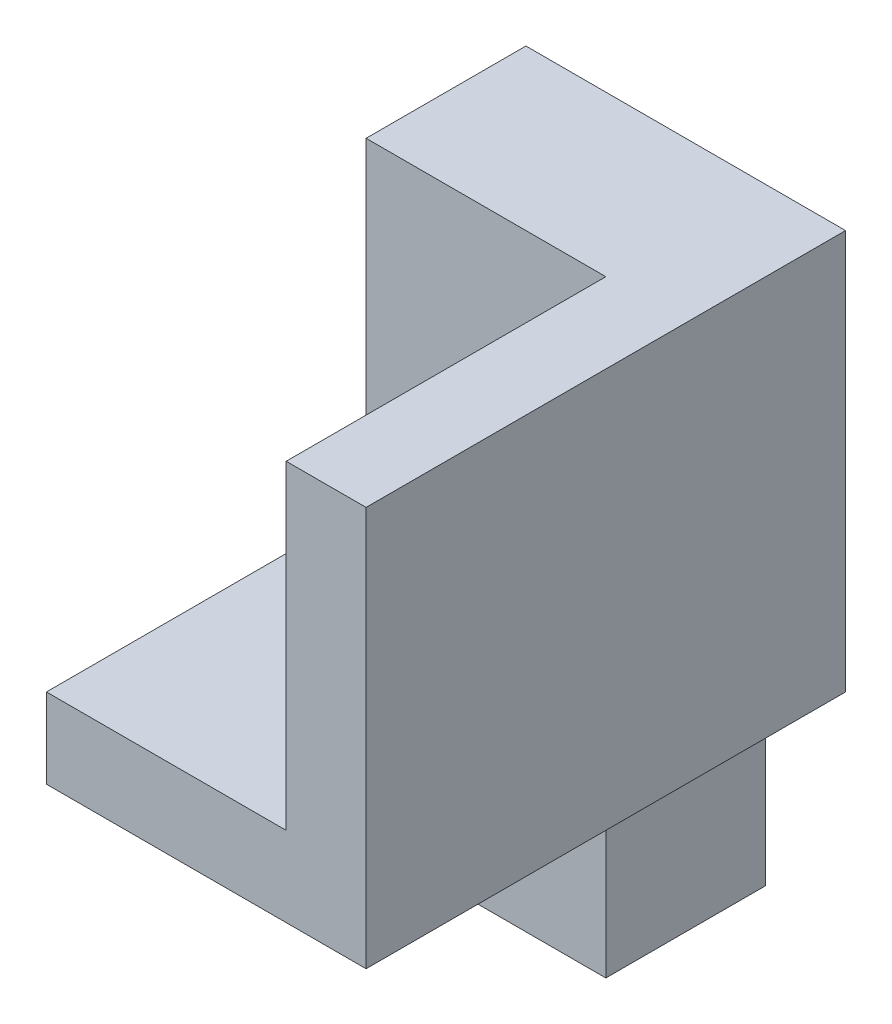
ISO-10303-21;
HEADER;
FILE_DESCRIPTION(('STEP AP214'),'2;1');
FILE_NAME('part.step','',(''),(''),'','','');
FILE_SCHEMA(('AUTOMOTIVE_DESIGN { 1 0 10303 214 1 1 1 1 }'));
ENDSEC;
DATA;
#1=APPLICATION_CONTEXT('core data for automotive mechanical design processes');
#2=APPLICATION_PROTOCOL_DEFINITION('international standard','automotive_design',2000,#1);
#3=PRODUCT_CONTEXT('',#1,'mechanical');
#4=PRODUCT('Part','Part','',(#3));
#5=PRODUCT_RELATED_PRODUCT_CATEGORY('part','',(#4));
#6=PRODUCT_DEFINITION_FORMATION('','',#4);
#7=PRODUCT_DEFINITION_CONTEXT('part definition',#1,'design');
#8=PRODUCT_DEFINITION('design','',#6,#7);
#9=PRODUCT_DEFINITION_SHAPE('','',#8);
#10=(LENGTH_UNIT() NAMED_UNIT(*) SI_UNIT(.MILLI.,.METRE.));
#11=(NAMED_UNIT(*) PLANE_ANGLE_UNIT() SI_UNIT($,.RADIAN.));
#12=(NAMED_UNIT(*) SI_UNIT($,.STERADIAN.) SOLID_ANGLE_UNIT());
#13=UNCERTAINTY_MEASURE_WITH_UNIT(LENGTH_MEASURE(1.E-05),#10,'distance_accuracy_value','');
#14=(GEOMETRIC_REPRESENTATION_CONTEXT(3) GLOBAL_UNCERTAINTY_ASSIGNED_CONTEXT((#13)) GLOBAL_UNIT_ASSIGNED_CONTEXT((#10,
#11,#12)) REPRESENTATION_CONTEXT('',''));
#15=CARTESIAN_POINT('',(0.,0.,0.));
#16=DIRECTION('',(0.,0.,1.));
#17=DIRECTION('',(1.,0.,0.));
#18=AXIS2_PLACEMENT_3D('',#15,#16,#17);
#19=CARTESIAN_POINT('',(0.,0.,0.));
#20=DIRECTION('',(1.,0.,0.));
#21=DIRECTION('',(0.,0.,-1.));
#22=AXIS2_PLACEMENT_3D('',#19,#20,#21);
#23=PLANE('',#22);
#24=DIRECTION('',(0.,0.,1.));
#25=VECTOR('',#24,1.);
#26=CARTESIAN_POINT('',(0.,-25.,30.));
#27=LINE('',#26,#25);
#28=CARTESIAN_POINT('',(0.,-25.,0.));
#29=VERTEX_POINT('',#28);
#30=CARTESIAN_POINT('',(0.,-25.,10.));
#31=VERTEX_POINT('',#30);
#32=EDGE_CURVE('E117',#29,#31,#27,.T.);
#33=ORIENTED_EDGE('',*,*,#32,.F.);
#34=DIRECTION('',(0.,1.,0.));
#35=VECTOR('',#34,1.);
#36=CARTESIAN_POINT('',(0.,-38.,0.));
#37=LINE('',#36,#35);
#38=CARTESIAN_POINT('',(0.,-38.,0.));
#39=VERTEX_POINT('',#38);
#40=EDGE_CURVE('E131',#39,#29,#37,.T.);
#41=ORIENTED_EDGE('',*,*,#40,.F.);
#42=DIRECTION('',(0.,0.,-1.));
#43=VECTOR('',#42,1.);
#44=CARTESIAN_POINT('',(0.,-38.,10.));
#45=LINE('',#44,#43);
#46=CARTESIAN_POINT('',(0.,-38.,10.));
#47=VERTEX_POINT('',#46);
#48=EDGE_CURVE('E82',#47,#39,#45,.T.);
#49=ORIENTED_EDGE('',*,*,#48,.F.);
#50=DIRECTION('',(0.,-1.,0.));
#51=VECTOR('',#50,1.);
#52=CARTESIAN_POINT('',(0.,-25.,10.));
#53=LINE('',#52,#51);
#54=EDGE_CURVE('E76',#31,#47,#53,.T.);
#55=ORIENTED_EDGE('',*,*,#54,.F.);
#56=EDGE_LOOP('',(#33,#41,#49,#55));
#57=FACE_BOUND('',#56,.T.);
#58=ADVANCED_FACE('F43',(#57),#23,.F.);
#59=CARTESIAN_POINT('',(10.,-38.,0.));
#60=DIRECTION('',(0.,0.,1.));
#61=DIRECTION('',(1.,0.,0.));
#62=AXIS2_PLACEMENT_3D('',#59,#60,#61);
#63=PLANE('',#62);
#64=ORIENTED_EDGE('',*,*,#40,.T.);
#65=DIRECTION('',(1.,0.,0.));
#66=VECTOR('',#65,1.);
#67=CARTESIAN_POINT('',(-5.,-25.,0.));
#68=LINE('',#67,#66);
#69=CARTESIAN_POINT('',(-5.,-25.,0.));
#70=VERTEX_POINT('',#69);
#71=EDGE_CURVE('E134',#70,#29,#68,.T.);
#72=ORIENTED_EDGE('',*,*,#71,.F.);
#73=DIRECTION('',(0.,-1.,0.));
#74=VECTOR('',#73,1.);
#75=CARTESIAN_POINT('',(-5.,-25.,0.));
#76=LINE('',#75,#74);
#77=CARTESIAN_POINT('',(-5.,0.,0.));
#78=VERTEX_POINT('',#77);
#79=EDGE_CURVE('E168',#78,#70,#76,.T.);
#80=ORIENTED_EDGE('',*,*,#79,.F.);
#81=DIRECTION('',(-1.,0.,0.));
#82=VECTOR('',#81,1.);
#83=CARTESIAN_POINT('',(10.,0.,0.));
#84=LINE('',#83,#82);
#85=CARTESIAN_POINT('',(15.,0.,0.));
#86=VERTEX_POINT('',#85);
#87=EDGE_CURVE('E47',#86,#78,#84,.T.);
#88=ORIENTED_EDGE('',*,*,#87,.F.);
#89=DIRECTION('',(0.,1.,0.));
#90=VECTOR('',#89,1.);
#91=CARTESIAN_POINT('',(15.,0.,0.));
#92=LINE('',#91,#90);
#93=CARTESIAN_POINT('',(15.,-25.,0.));
#94=VERTEX_POINT('',#93);
#95=EDGE_CURVE('E232',#94,#86,#92,.T.);
#96=ORIENTED_EDGE('',*,*,#95,.F.);
#97=DIRECTION('',(-1.,0.,0.));
#98=VECTOR('',#97,1.);
#99=CARTESIAN_POINT('',(15.,-25.,0.));
#100=LINE('',#99,#98);
#101=CARTESIAN_POINT('',(10.,-25.,0.));
#102=VERTEX_POINT('',#101);
#103=EDGE_CURVE('E234',#94,#102,#100,.T.);
#104=ORIENTED_EDGE('',*,*,#103,.T.);
#105=DIRECTION('',(0.,1.,0.));
#106=VECTOR('',#105,1.);
#107=CARTESIAN_POINT('',(10.,-38.,0.));
#108=LINE('',#107,#106);
#109=CARTESIAN_POINT('',(10.,-38.,0.));
#110=VERTEX_POINT('',#109);
#111=EDGE_CURVE('E108',#110,#102,#108,.T.);
#112=ORIENTED_EDGE('',*,*,#111,.F.);
#113=DIRECTION('',(-1.,0.,0.));
#114=VECTOR('',#113,1.);
#115=CARTESIAN_POINT('',(10.,-38.,0.));
#116=LINE('',#115,#114);
#117=EDGE_CURVE('E124',#110,#39,#116,.T.);
#118=ORIENTED_EDGE('',*,*,#117,.T.);
#119=EDGE_LOOP('',(#64,#72,#80,#88,#96,#104,#112,#118));
#120=FACE_BOUND('',#119,.T.);
#121=ADVANCED_FACE('F45',(#120),#63,.F.);
#122=CARTESIAN_POINT('',(10.,0.,0.));
#123=DIRECTION('',(0.,-1.,0.));
#124=DIRECTION('',(0.,0.,-1.));
#125=AXIS2_PLACEMENT_3D('',#122,#123,#124);
#126=PLANE('',#125);
#127=ORIENTED_EDGE('',*,*,#87,.T.);
#128=DIRECTION('',(0.,0.,-1.));
#129=VECTOR('',#128,1.);
#130=CARTESIAN_POINT('',(-5.,0.,0.));
#131=LINE('',#130,#129);
#132=CARTESIAN_POINT('',(-5.,0.,10.));
#133=VERTEX_POINT('',#132);
#134=EDGE_CURVE('E154',#133,#78,#131,.T.);
#135=ORIENTED_EDGE('',*,*,#134,.F.);
#136=DIRECTION('',(-1.,0.,0.));
#137=VECTOR('',#136,1.);
#138=CARTESIAN_POINT('',(10.,0.,10.));
#139=LINE('',#138,#137);
#140=CARTESIAN_POINT('',(10.,0.,10.));
#141=VERTEX_POINT('',#140);
#142=EDGE_CURVE('E91',#141,#133,#139,.T.);
#143=ORIENTED_EDGE('',*,*,#142,.F.);
#144=DIRECTION('',(0.,0.,1.));
#145=VECTOR('',#144,1.);
#146=CARTESIAN_POINT('',(10.,0.,0.));
#147=LINE('',#146,#145);
#148=CARTESIAN_POINT('',(10.,0.,30.));
#149=VERTEX_POINT('',#148);
#150=EDGE_CURVE('E195',#141,#149,#147,.T.);
#151=ORIENTED_EDGE('',*,*,#150,.T.);
#152=DIRECTION('',(-1.,0.,0.));
#153=VECTOR('',#152,1.);
#154=CARTESIAN_POINT('',(15.,0.,30.));
#155=LINE('',#154,#153);
#156=CARTESIAN_POINT('',(15.,0.,30.));
#157=VERTEX_POINT('',#156);
#158=EDGE_CURVE('E177',#157,#149,#155,.T.);
#159=ORIENTED_EDGE('',*,*,#158,.F.);
#160=DIRECTION('',(0.,0.,1.));
#161=VECTOR('',#160,1.);
#162=CARTESIAN_POINT('',(15.,0.,0.));
#163=LINE('',#162,#161);
#164=EDGE_CURVE('E158',#86,#157,#163,.T.);
#165=ORIENTED_EDGE('',*,*,#164,.F.);
#166=EDGE_LOOP('',(#127,#135,#143,#151,#159,#165));
#167=FACE_BOUND('',#166,.T.);
#168=ADVANCED_FACE('F153',(#167),#126,.F.);
#169=CARTESIAN_POINT('',(10.,0.,10.));
#170=DIRECTION('',(0.,0.,-1.));
#171=DIRECTION('',(0.,1.,0.));
#172=AXIS2_PLACEMENT_3D('',#169,#170,#171);
#173=PLANE('',#172);
#174=ORIENTED_EDGE('',*,*,#142,.T.);
#175=DIRECTION('',(0.,1.,0.));
#176=VECTOR('',#175,1.);
#177=CARTESIAN_POINT('',(-5.,0.,10.));
#178=LINE('',#177,#176);
#179=CARTESIAN_POINT('',(-5.,-20.,10.));
#180=VERTEX_POINT('',#179);
#181=EDGE_CURVE('E171',#180,#133,#178,.T.);
#182=ORIENTED_EDGE('',*,*,#181,.F.);
#183=DIRECTION('',(-1.,0.,0.));
#184=VECTOR('',#183,1.);
#185=CARTESIAN_POINT('',(10.,-20.,10.));
#186=LINE('',#185,#184);
#187=CARTESIAN_POINT('',(10.,-20.,10.));
#188=VERTEX_POINT('',#187);
#189=EDGE_CURVE('E143',#188,#180,#186,.T.);
#190=ORIENTED_EDGE('',*,*,#189,.F.);
#191=DIRECTION('',(0.,-1.,0.));
#192=VECTOR('',#191,1.);
#193=CARTESIAN_POINT('',(10.,0.,10.));
#194=LINE('',#193,#192);
#195=EDGE_CURVE('E127',#141,#188,#194,.T.);
#196=ORIENTED_EDGE('',*,*,#195,.F.);
#197=EDGE_LOOP('',(#174,#182,#190,#196));
#198=FACE_BOUND('',#197,.T.);
#199=ADVANCED_FACE('F196',(#198),#173,.F.);
#200=CARTESIAN_POINT('',(10.,-20.,10.));
#201=DIRECTION('',(0.,-1.,0.));
#202=DIRECTION('',(0.,0.,-1.));
#203=AXIS2_PLACEMENT_3D('',#200,#201,#202);
#204=PLANE('',#203);
#205=ORIENTED_EDGE('',*,*,#189,.T.);
#206=DIRECTION('',(0.,0.,-1.));
#207=VECTOR('',#206,1.);
#208=CARTESIAN_POINT('',(-5.,-20.,10.));
#209=LINE('',#208,#207);
#210=CARTESIAN_POINT('',(-5.,-20.,30.));
#211=VERTEX_POINT('',#210);
#212=EDGE_CURVE('E184',#211,#180,#209,.T.);
#213=ORIENTED_EDGE('',*,*,#212,.F.);
#214=DIRECTION('',(-1.,0.,0.));
#215=VECTOR('',#214,1.);
#216=CARTESIAN_POINT('',(10.,-20.,30.));
#217=LINE('',#216,#215);
#218=CARTESIAN_POINT('',(10.,-20.,30.));
#219=VERTEX_POINT('',#218);
#220=EDGE_CURVE('E140',#219,#211,#217,.T.);
#221=ORIENTED_EDGE('',*,*,#220,.F.);
#222=DIRECTION('',(0.,0.,1.));
#223=VECTOR('',#222,1.);
#224=CARTESIAN_POINT('',(10.,-20.,10.));
#225=LINE('',#224,#223);
#226=EDGE_CURVE('E122',#188,#219,#225,.T.);
#227=ORIENTED_EDGE('',*,*,#226,.F.);
#228=EDGE_LOOP('',(#205,#213,#221,#227));
#229=FACE_BOUND('',#228,.T.);
#230=ADVANCED_FACE('F200',(#229),#204,.F.);
#231=CARTESIAN_POINT('',(10.,-20.,30.));
#232=DIRECTION('',(0.,0.,-1.));
#233=DIRECTION('',(0.,1.,0.));
#234=AXIS2_PLACEMENT_3D('',#231,#232,#233);
#235=PLANE('',#234);
#236=ORIENTED_EDGE('',*,*,#220,.T.);
#237=DIRECTION('',(0.,1.,0.));
#238=VECTOR('',#237,1.);
#239=CARTESIAN_POINT('',(-5.,-20.,30.));
#240=LINE('',#239,#238);
#241=CARTESIAN_POINT('',(-5.,-25.,30.));
#242=VERTEX_POINT('',#241);
#243=EDGE_CURVE('E175',#242,#211,#240,.T.);
#244=ORIENTED_EDGE('',*,*,#243,.F.);
#245=DIRECTION('',(-1.,0.,0.));
#246=VECTOR('',#245,1.);
#247=CARTESIAN_POINT('',(10.,-25.,30.));
#248=LINE('',#247,#246);
#249=CARTESIAN_POINT('',(15.,-25.,30.));
#250=VERTEX_POINT('',#249);
#251=EDGE_CURVE('E118',#250,#242,#248,.T.);
#252=ORIENTED_EDGE('',*,*,#251,.F.);
#253=DIRECTION('',(0.,-1.,0.));
#254=VECTOR('',#253,1.);
#255=CARTESIAN_POINT('',(15.,0.,30.));
#256=LINE('',#255,#254);
#257=EDGE_CURVE('E231',#157,#250,#256,.T.);
#258=ORIENTED_EDGE('',*,*,#257,.F.);
#259=ORIENTED_EDGE('',*,*,#158,.T.);
#260=DIRECTION('',(0.,-1.,0.));
#261=VECTOR('',#260,1.);
#262=CARTESIAN_POINT('',(10.,0.,30.));
#263=LINE('',#262,#261);
#264=EDGE_CURVE('E208',#149,#219,#263,.T.);
#265=ORIENTED_EDGE('',*,*,#264,.T.);
#266=EDGE_LOOP('',(#236,#244,#252,#258,#259,#265));
#267=FACE_BOUND('',#266,.T.);
#268=ADVANCED_FACE('F204',(#267),#235,.F.);
#269=CARTESIAN_POINT('',(10.,-25.,30.));
#270=DIRECTION('',(0.,1.,0.));
#271=DIRECTION('',(0.,0.,1.));
#272=AXIS2_PLACEMENT_3D('',#269,#270,#271);
#273=PLANE('',#272);
#274=ORIENTED_EDGE('',*,*,#251,.T.);
#275=DIRECTION('',(0.,0.,1.));
#276=VECTOR('',#275,1.);
#277=CARTESIAN_POINT('',(-5.,-25.,30.));
#278=LINE('',#277,#276);
#279=EDGE_CURVE('E173',#70,#242,#278,.T.);
#280=ORIENTED_EDGE('',*,*,#279,.F.);
#281=ORIENTED_EDGE('',*,*,#71,.T.);
#282=ORIENTED_EDGE('',*,*,#32,.T.);
#283=DIRECTION('',(-1.,0.,0.));
#284=VECTOR('',#283,1.);
#285=CARTESIAN_POINT('',(10.,-25.,10.));
#286=LINE('',#285,#284);
#287=CARTESIAN_POINT('',(10.,-25.,10.));
#288=VERTEX_POINT('',#287);
#289=EDGE_CURVE('E112',#288,#31,#286,.T.);
#290=ORIENTED_EDGE('',*,*,#289,.F.);
#291=DIRECTION('',(0.,0.,-1.));
#292=VECTOR('',#291,1.);
#293=CARTESIAN_POINT('',(10.,-25.,0.));
#294=LINE('',#293,#292);
#295=EDGE_CURVE('E11',#288,#102,#294,.T.);
#296=ORIENTED_EDGE('',*,*,#295,.T.);
#297=ORIENTED_EDGE('',*,*,#103,.F.);
#298=DIRECTION('',(0.,0.,-1.));
#299=VECTOR('',#298,1.);
#300=CARTESIAN_POINT('',(15.,-25.,0.));
#301=LINE('',#300,#299);
#302=EDGE_CURVE('E235',#250,#94,#301,.T.);
#303=ORIENTED_EDGE('',*,*,#302,.F.);
#304=EDGE_LOOP('',(#274,#280,#281,#282,#290,#296,#297,#303));
#305=FACE_BOUND('',#304,.T.);
#306=ADVANCED_FACE('F114',(#305),#273,.F.);
#307=CARTESIAN_POINT('',(10.,-25.,10.));
#308=DIRECTION('',(0.,0.,-1.));
#309=DIRECTION('',(0.,1.,0.));
#310=AXIS2_PLACEMENT_3D('',#307,#308,#309);
#311=PLANE('',#310);
#312=ORIENTED_EDGE('',*,*,#54,.T.);
#313=DIRECTION('',(-1.,0.,0.));
#314=VECTOR('',#313,1.);
#315=CARTESIAN_POINT('',(10.,-38.,10.));
#316=LINE('',#315,#314);
#317=CARTESIAN_POINT('',(10.,-38.,10.));
#318=VERTEX_POINT('',#317);
#319=EDGE_CURVE('E119',#318,#47,#316,.T.);
#320=ORIENTED_EDGE('',*,*,#319,.F.);
#321=DIRECTION('',(0.,-1.,0.));
#322=VECTOR('',#321,1.);
#323=CARTESIAN_POINT('',(10.,-25.,10.));
#324=LINE('',#323,#322);
#325=EDGE_CURVE('E105',#288,#318,#324,.T.);
#326=ORIENTED_EDGE('',*,*,#325,.F.);
#327=ORIENTED_EDGE('',*,*,#289,.T.);
#328=EDGE_LOOP('',(#312,#320,#326,#327));
#329=FACE_BOUND('',#328,.T.);
#330=ADVANCED_FACE('F121',(#329),#311,.F.);
#331=CARTESIAN_POINT('',(10.,-38.,10.));
#332=DIRECTION('',(0.,1.,0.));
#333=DIRECTION('',(0.,0.,1.));
#334=AXIS2_PLACEMENT_3D('',#331,#332,#333);
#335=PLANE('',#334);
#336=ORIENTED_EDGE('',*,*,#48,.T.);
#337=ORIENTED_EDGE('',*,*,#117,.F.);
#338=DIRECTION('',(0.,0.,-1.));
#339=VECTOR('',#338,1.);
#340=CARTESIAN_POINT('',(10.,-38.,10.));
#341=LINE('',#340,#339);
#342=EDGE_CURVE('E61',#318,#110,#341,.T.);
#343=ORIENTED_EDGE('',*,*,#342,.F.);
#344=ORIENTED_EDGE('',*,*,#319,.T.);
#345=EDGE_LOOP('',(#336,#337,#343,#344));
#346=FACE_BOUND('',#345,.T.);
#347=ADVANCED_FACE('F253',(#346),#335,.F.);
#348=CARTESIAN_POINT('',(10.,0.,0.));
#349=DIRECTION('',(1.,0.,0.));
#350=DIRECTION('',(0.,0.,-1.));
#351=AXIS2_PLACEMENT_3D('',#348,#349,#350);
#352=PLANE('',#351);
#353=ORIENTED_EDGE('',*,*,#295,.F.);
#354=ORIENTED_EDGE('',*,*,#325,.T.);
#355=ORIENTED_EDGE('',*,*,#342,.T.);
#356=ORIENTED_EDGE('',*,*,#111,.T.);
#357=EDGE_LOOP('',(#353,#354,#355,#356));
#358=FACE_BOUND('',#357,.T.);
#359=ADVANCED_FACE('F103',(#358),#352,.T.);
#360=CARTESIAN_POINT('',(-5.,0.,0.));
#361=DIRECTION('',(1.,0.,0.));
#362=DIRECTION('',(0.,0.,-1.));
#363=AXIS2_PLACEMENT_3D('',#360,#361,#362);
#364=PLANE('',#363);
#365=ORIENTED_EDGE('',*,*,#79,.T.);
#366=ORIENTED_EDGE('',*,*,#279,.T.);
#367=ORIENTED_EDGE('',*,*,#243,.T.);
#368=ORIENTED_EDGE('',*,*,#212,.T.);
#369=ORIENTED_EDGE('',*,*,#181,.T.);
#370=ORIENTED_EDGE('',*,*,#134,.T.);
#371=EDGE_LOOP('',(#365,#366,#367,#368,#369,#370));
#372=FACE_BOUND('',#371,.T.);
#373=ADVANCED_FACE('F165',(#372),#364,.F.);
#374=CARTESIAN_POINT('',(15.,0.,0.));
#375=DIRECTION('',(-1.,0.,0.));
#376=DIRECTION('',(0.,0.,1.));
#377=AXIS2_PLACEMENT_3D('',#374,#375,#376);
#378=PLANE('',#377);
#379=ORIENTED_EDGE('',*,*,#95,.T.);
#380=ORIENTED_EDGE('',*,*,#164,.T.);
#381=ORIENTED_EDGE('',*,*,#257,.T.);
#382=ORIENTED_EDGE('',*,*,#302,.T.);
#383=EDGE_LOOP('',(#379,#380,#381,#382));
#384=FACE_BOUND('',#383,.T.);
#385=ADVANCED_FACE('F229',(#384),#378,.F.);
#386=CARTESIAN_POINT('',(10.,0.,0.));
#387=DIRECTION('',(-1.,0.,0.));
#388=DIRECTION('',(0.,0.,1.));
#389=AXIS2_PLACEMENT_3D('',#386,#387,#388);
#390=PLANE('',#389);
#391=ORIENTED_EDGE('',*,*,#150,.F.);
#392=ORIENTED_EDGE('',*,*,#195,.T.);
#393=ORIENTED_EDGE('',*,*,#226,.T.);
#394=ORIENTED_EDGE('',*,*,#264,.F.);
#395=EDGE_LOOP('',(#391,#392,#393,#394));
#396=FACE_BOUND('',#395,.T.);
#397=ADVANCED_FACE('F191',(#396),#390,.T.);
#398=CLOSED_SHELL('',(#58,#121,#168,#199,#230,#268,#306,#330,#347,#359,#373,#385,#397));
#399=MANIFOLD_SOLID_BREP('B2',#398);
#400=ADVANCED_BREP_SHAPE_REPRESENTATION('',(#18,#399),#14);
#401=SHAPE_DEFINITION_REPRESENTATION(#9,#400);
ENDSEC;
END-ISO-10303-21;
